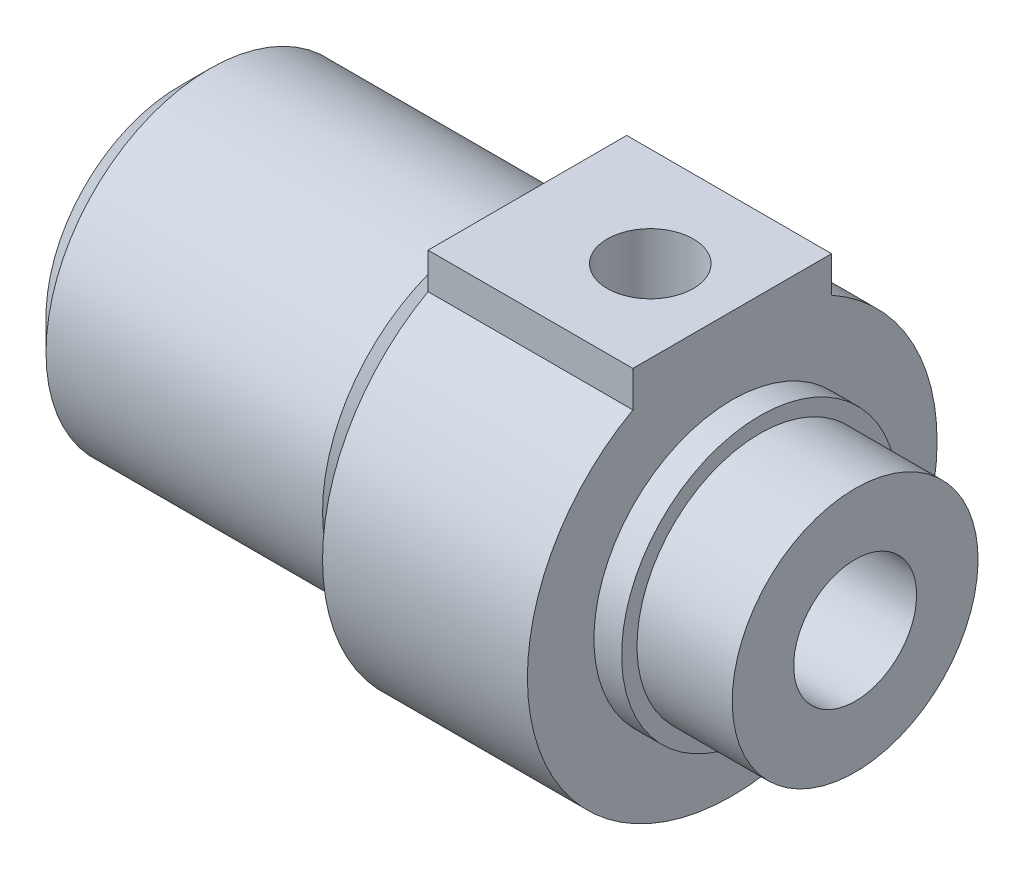
ISO-10303-21;
HEADER;
FILE_DESCRIPTION(('STEP AP214'),'2;1');
FILE_NAME('part.step','',(''),(''),'','','');
FILE_SCHEMA(('AUTOMOTIVE_DESIGN { 1 0 10303 214 1 1 1 1 }'));
ENDSEC;
DATA;
#1=APPLICATION_CONTEXT('core data for automotive mechanical design processes');
#2=APPLICATION_PROTOCOL_DEFINITION('international standard','automotive_design',2000,#1);
#3=PRODUCT_CONTEXT('',#1,'mechanical');
#4=PRODUCT('Part','Part','',(#3));
#5=PRODUCT_RELATED_PRODUCT_CATEGORY('part','',(#4));
#6=PRODUCT_DEFINITION_FORMATION('','',#4);
#7=PRODUCT_DEFINITION_CONTEXT('part definition',#1,'design');
#8=PRODUCT_DEFINITION('design','',#6,#7);
#9=PRODUCT_DEFINITION_SHAPE('','',#8);
#10=(LENGTH_UNIT() NAMED_UNIT(*) SI_UNIT(.MILLI.,.METRE.));
#11=(NAMED_UNIT(*) PLANE_ANGLE_UNIT() SI_UNIT($,.RADIAN.));
#12=(NAMED_UNIT(*) SI_UNIT($,.STERADIAN.) SOLID_ANGLE_UNIT());
#13=UNCERTAINTY_MEASURE_WITH_UNIT(LENGTH_MEASURE(1.E-05),#10,'distance_accuracy_value','');
#14=(GEOMETRIC_REPRESENTATION_CONTEXT(3) GLOBAL_UNCERTAINTY_ASSIGNED_CONTEXT((#13)) GLOBAL_UNIT_ASSIGNED_CONTEXT((#10,
#11,#12)) REPRESENTATION_CONTEXT('',''));
#15=CARTESIAN_POINT('',(0.,0.,0.));
#16=DIRECTION('',(0.,0.,1.));
#17=DIRECTION('',(1.,0.,0.));
#18=AXIS2_PLACEMENT_3D('',#15,#16,#17);
#19=CARTESIAN_POINT('',(33.,10.5,4.85));
#20=DIRECTION('',(0.,-1.,0.));
#21=DIRECTION('',(0.,0.,-1.));
#22=AXIS2_PLACEMENT_3D('',#19,#20,#21);
#23=PLANE('',#22);
#24=CARTESIAN_POINT('',(23.,10.5,0.));
#25=DIRECTION('',(0.,1.,0.));
#26=DIRECTION('',(0.,0.,1.));
#27=AXIS2_PLACEMENT_3D('',#24,#25,#26);
#28=CIRCLE('',#27,2.1);
#29=CARTESIAN_POINT('',(23.,10.5,2.1));
#30=VERTEX_POINT('',#29);
#31=EDGE_CURVE('E196',#30,#30,#28,.T.);
#32=ORIENTED_EDGE('',*,*,#31,.F.);
#33=EDGE_LOOP('',(#32));
#34=FACE_BOUND('',#33,.T.);
#35=DIRECTION('',(0.,0.,-1.));
#36=VECTOR('',#35,1.);
#37=CARTESIAN_POINT('',(17.,10.5,4.85));
#38=LINE('',#37,#36);
#39=CARTESIAN_POINT('',(17.,10.5,4.85));
#40=VERTEX_POINT('',#39);
#41=CARTESIAN_POINT('',(17.,10.5,-4.85));
#42=VERTEX_POINT('',#41);
#43=EDGE_CURVE('E58',#40,#42,#38,.T.);
#44=ORIENTED_EDGE('',*,*,#43,.F.);
#45=DIRECTION('',(-1.,0.,0.));
#46=VECTOR('',#45,1.);
#47=CARTESIAN_POINT('',(33.,10.5,4.85));
#48=LINE('',#47,#46);
#49=CARTESIAN_POINT('',(27.,10.5,4.85));
#50=VERTEX_POINT('',#49);
#51=EDGE_CURVE('E105',#50,#40,#48,.T.);
#52=ORIENTED_EDGE('',*,*,#51,.F.);
#53=DIRECTION('',(0.,0.,-1.));
#54=VECTOR('',#53,1.);
#55=CARTESIAN_POINT('',(27.,10.5,4.85));
#56=LINE('',#55,#54);
#57=CARTESIAN_POINT('',(27.,10.5,-4.85));
#58=VERTEX_POINT('',#57);
#59=EDGE_CURVE('E107',#50,#58,#56,.T.);
#60=ORIENTED_EDGE('',*,*,#59,.T.);
#61=DIRECTION('',(-1.,0.,0.));
#62=VECTOR('',#61,1.);
#63=CARTESIAN_POINT('',(33.,10.5,-4.85));
#64=LINE('',#63,#62);
#65=EDGE_CURVE('E103',#58,#42,#64,.T.);
#66=ORIENTED_EDGE('',*,*,#65,.T.);
#67=EDGE_LOOP('',(#44,#52,#60,#66));
#68=FACE_BOUND('',#67,.T.);
#69=ADVANCED_FACE('F37',(#34,#68),#23,.F.);
#70=CARTESIAN_POINT('',(33.,8.74514150828905,4.85));
#71=DIRECTION('',(0.,0.,-1.));
#72=DIRECTION('',(-1.,0.,0.));
#73=AXIS2_PLACEMENT_3D('',#70,#71,#72);
#74=PLANE('',#73);
#75=DIRECTION('',(0.,1.,0.));
#76=VECTOR('',#75,1.);
#77=CARTESIAN_POINT('',(17.,8.74514150828905,4.85));
#78=LINE('',#77,#76);
#79=CARTESIAN_POINT('',(17.,8.74514150828905,4.85));
#80=VERTEX_POINT('',#79);
#81=EDGE_CURVE('E99',#80,#40,#78,.T.);
#82=ORIENTED_EDGE('',*,*,#81,.F.);
#83=DIRECTION('',(-1.,0.,0.));
#84=VECTOR('',#83,1.);
#85=CARTESIAN_POINT('',(33.,8.74514150828905,4.85));
#86=LINE('',#85,#84);
#87=CARTESIAN_POINT('',(27.,8.74514150828905,4.85));
#88=VERTEX_POINT('',#87);
#89=EDGE_CURVE('E98',#88,#80,#86,.T.);
#90=ORIENTED_EDGE('',*,*,#89,.F.);
#91=DIRECTION('',(0.,1.,0.));
#92=VECTOR('',#91,1.);
#93=CARTESIAN_POINT('',(27.,8.74514150828905,4.85));
#94=LINE('',#93,#92);
#95=EDGE_CURVE('E225',#88,#50,#94,.T.);
#96=ORIENTED_EDGE('',*,*,#95,.T.);
#97=ORIENTED_EDGE('',*,*,#51,.T.);
#98=EDGE_LOOP('',(#82,#90,#96,#97));
#99=FACE_BOUND('',#98,.T.);
#100=ADVANCED_FACE('F133',(#99),#74,.F.);
#101=CARTESIAN_POINT('',(33.,0.,0.));
#102=DIRECTION('',(-1.,0.,0.));
#103=DIRECTION('',(0.,0.,1.));
#104=AXIS2_PLACEMENT_3D('',#101,#102,#103);
#105=CYLINDRICAL_SURFACE('',#104,10.);
#106=CARTESIAN_POINT('',(17.,0.,0.));
#107=DIRECTION('',(-1.,0.,0.));
#108=DIRECTION('',(0.,0.,1.));
#109=AXIS2_PLACEMENT_3D('',#106,#107,#108);
#110=CIRCLE('',#109,10.);
#111=CARTESIAN_POINT('',(17.,8.74514150828905,-4.85));
#112=VERTEX_POINT('',#111);
#113=EDGE_CURVE('E84',#112,#80,#110,.T.);
#114=ORIENTED_EDGE('',*,*,#113,.F.);
#115=DIRECTION('',(-1.,0.,0.));
#116=VECTOR('',#115,1.);
#117=CARTESIAN_POINT('',(33.,8.74514150828905,-4.85));
#118=LINE('',#117,#116);
#119=CARTESIAN_POINT('',(27.,8.74514150828905,-4.85));
#120=VERTEX_POINT('',#119);
#121=EDGE_CURVE('E96',#120,#112,#118,.T.);
#122=ORIENTED_EDGE('',*,*,#121,.F.);
#123=CARTESIAN_POINT('',(27.,0.,0.));
#124=DIRECTION('',(-1.,0.,0.));
#125=DIRECTION('',(0.,-1.,0.));
#126=AXIS2_PLACEMENT_3D('',#123,#124,#125);
#127=CIRCLE('',#126,10.);
#128=EDGE_CURVE('E66',#120,#88,#127,.T.);
#129=ORIENTED_EDGE('',*,*,#128,.T.);
#130=ORIENTED_EDGE('',*,*,#89,.T.);
#131=EDGE_LOOP('',(#114,#122,#129,#130));
#132=FACE_BOUND('',#131,.T.);
#133=ADVANCED_FACE('F95',(#132),#105,.T.);
#134=CARTESIAN_POINT('',(33.,8.74514150828905,-4.85));
#135=DIRECTION('',(0.,0.,1.));
#136=DIRECTION('',(1.,0.,0.));
#137=AXIS2_PLACEMENT_3D('',#134,#135,#136);
#138=PLANE('',#137);
#139=DIRECTION('',(0.,-1.,0.));
#140=VECTOR('',#139,1.);
#141=CARTESIAN_POINT('',(17.,8.74514150828905,-4.85));
#142=LINE('',#141,#140);
#143=EDGE_CURVE('E81',#42,#112,#142,.T.);
#144=ORIENTED_EDGE('',*,*,#143,.F.);
#145=ORIENTED_EDGE('',*,*,#65,.F.);
#146=DIRECTION('',(0.,-1.,0.));
#147=VECTOR('',#146,1.);
#148=CARTESIAN_POINT('',(27.,8.74514150828905,-4.85));
#149=LINE('',#148,#147);
#150=EDGE_CURVE('E90',#58,#120,#149,.T.);
#151=ORIENTED_EDGE('',*,*,#150,.T.);
#152=ORIENTED_EDGE('',*,*,#121,.T.);
#153=EDGE_LOOP('',(#144,#145,#151,#152));
#154=FACE_BOUND('',#153,.T.);
#155=ADVANCED_FACE('F102',(#154),#138,.F.);
#156=CARTESIAN_POINT('',(27.,14.,0.));
#157=DIRECTION('',(-1.,0.,0.));
#158=DIRECTION('',(0.,-1.,0.));
#159=AXIS2_PLACEMENT_3D('',#156,#157,#158);
#160=PLANE('',#159);
#161=CARTESIAN_POINT('',(27.,0.,0.));
#162=DIRECTION('',(1.,0.,0.));
#163=DIRECTION('',(0.,1.,0.));
#164=AXIS2_PLACEMENT_3D('',#161,#162,#163);
#165=CIRCLE('',#164,6.75);
#166=CARTESIAN_POINT('',(27.,6.75,0.));
#167=VERTEX_POINT('',#166);
#168=EDGE_CURVE('E221',#167,#167,#165,.T.);
#169=ORIENTED_EDGE('',*,*,#168,.F.);
#170=EDGE_LOOP('',(#169));
#171=FACE_BOUND('',#170,.T.);
#172=ORIENTED_EDGE('',*,*,#95,.F.);
#173=ORIENTED_EDGE('',*,*,#128,.F.);
#174=ORIENTED_EDGE('',*,*,#150,.F.);
#175=ORIENTED_EDGE('',*,*,#59,.F.);
#176=EDGE_LOOP('',(#172,#173,#174,#175));
#177=FACE_BOUND('',#176,.T.);
#178=ADVANCED_FACE('F146',(#171,#177),#160,.F.);
#179=CARTESIAN_POINT('',(45.5,0.,0.));
#180=DIRECTION('',(1.,0.,0.));
#181=DIRECTION('',(0.,1.,0.));
#182=AXIS2_PLACEMENT_3D('',#179,#180,#181);
#183=CYLINDRICAL_SURFACE('',#182,6.75);
#184=CARTESIAN_POINT('',(28.35,0.,0.));
#185=DIRECTION('',(1.,0.,0.));
#186=DIRECTION('',(0.,1.,0.));
#187=AXIS2_PLACEMENT_3D('',#184,#185,#186);
#188=CIRCLE('',#187,6.75);
#189=CARTESIAN_POINT('',(28.35,6.75,0.));
#190=VERTEX_POINT('',#189);
#191=EDGE_CURVE('E218',#190,#190,#188,.T.);
#192=ORIENTED_EDGE('',*,*,#191,.F.);
#193=EDGE_LOOP('',(#192));
#194=FACE_BOUND('',#193,.T.);
#195=ORIENTED_EDGE('',*,*,#168,.T.);
#196=EDGE_LOOP('',(#195));
#197=FACE_BOUND('',#196,.T.);
#198=ADVANCED_FACE('F155',(#194,#197),#183,.T.);
#199=CARTESIAN_POINT('',(28.35,6.75,0.));
#200=DIRECTION('',(-1.,0.,0.));
#201=DIRECTION('',(0.,-1.,0.));
#202=AXIS2_PLACEMENT_3D('',#199,#200,#201);
#203=PLANE('',#202);
#204=CARTESIAN_POINT('',(28.35,0.,0.));
#205=DIRECTION('',(1.,0.,0.));
#206=DIRECTION('',(0.,1.,0.));
#207=AXIS2_PLACEMENT_3D('',#204,#205,#206);
#208=CIRCLE('',#207,6.);
#209=CARTESIAN_POINT('',(28.35,6.,0.));
#210=VERTEX_POINT('',#209);
#211=EDGE_CURVE('E215',#210,#210,#208,.T.);
#212=ORIENTED_EDGE('',*,*,#211,.F.);
#213=EDGE_LOOP('',(#212));
#214=FACE_BOUND('',#213,.T.);
#215=ORIENTED_EDGE('',*,*,#191,.T.);
#216=EDGE_LOOP('',(#215));
#217=FACE_BOUND('',#216,.T.);
#218=ADVANCED_FACE('F159',(#214,#217),#203,.F.);
#219=CARTESIAN_POINT('',(45.5,0.,0.));
#220=DIRECTION('',(1.,0.,0.));
#221=DIRECTION('',(0.,1.,0.));
#222=AXIS2_PLACEMENT_3D('',#219,#220,#221);
#223=CYLINDRICAL_SURFACE('',#222,6.);
#224=CARTESIAN_POINT('',(33.,0.,0.));
#225=DIRECTION('',(1.,0.,0.));
#226=DIRECTION('',(0.,1.,0.));
#227=AXIS2_PLACEMENT_3D('',#224,#225,#226);
#228=CIRCLE('',#227,6.);
#229=CARTESIAN_POINT('',(33.,6.,0.));
#230=VERTEX_POINT('',#229);
#231=EDGE_CURVE('E212',#230,#230,#228,.T.);
#232=ORIENTED_EDGE('',*,*,#231,.F.);
#233=EDGE_LOOP('',(#232));
#234=FACE_BOUND('',#233,.T.);
#235=ORIENTED_EDGE('',*,*,#211,.T.);
#236=EDGE_LOOP('',(#235));
#237=FACE_BOUND('',#236,.T.);
#238=ADVANCED_FACE('F151',(#234,#237),#223,.T.);
#239=CARTESIAN_POINT('',(33.,0.,0.));
#240=DIRECTION('',(1.,0.,0.));
#241=DIRECTION('',(0.,0.,-1.));
#242=AXIS2_PLACEMENT_3D('',#239,#240,#241);
#243=PLANE('',#242);
#244=CARTESIAN_POINT('',(33.,0.,0.));
#245=DIRECTION('',(1.,0.,0.));
#246=DIRECTION('',(0.,0.,-1.));
#247=AXIS2_PLACEMENT_3D('',#244,#245,#246);
#248=CIRCLE('',#247,3.);
#249=CARTESIAN_POINT('',(33.,0.,-3.));
#250=VERTEX_POINT('',#249);
#251=EDGE_CURVE('E189',#250,#250,#248,.T.);
#252=ORIENTED_EDGE('',*,*,#251,.F.);
#253=EDGE_LOOP('',(#252));
#254=FACE_BOUND('',#253,.T.);
#255=ORIENTED_EDGE('',*,*,#231,.T.);
#256=EDGE_LOOP('',(#255));
#257=FACE_BOUND('',#256,.T.);
#258=ADVANCED_FACE('F148',(#254,#257),#243,.T.);
#259=CARTESIAN_POINT('',(17.,7.5,0.));
#260=DIRECTION('',(-1.,0.,0.));
#261=DIRECTION('',(0.,0.,1.));
#262=AXIS2_PLACEMENT_3D('',#259,#260,#261);
#263=PLANE('',#262);
#264=CARTESIAN_POINT('',(17.,0.,0.));
#265=DIRECTION('',(-1.,0.,0.));
#266=DIRECTION('',(0.,0.,1.));
#267=AXIS2_PLACEMENT_3D('',#264,#265,#266);
#268=CIRCLE('',#267,7.5);
#269=CARTESIAN_POINT('',(17.,0.,7.5));
#270=VERTEX_POINT('',#269);
#271=EDGE_CURVE('E100',#270,#270,#268,.T.);
#272=ORIENTED_EDGE('',*,*,#271,.F.);
#273=EDGE_LOOP('',(#272));
#274=FACE_BOUND('',#273,.T.);
#275=ORIENTED_EDGE('',*,*,#43,.T.);
#276=ORIENTED_EDGE('',*,*,#143,.T.);
#277=ORIENTED_EDGE('',*,*,#113,.T.);
#278=ORIENTED_EDGE('',*,*,#81,.T.);
#279=EDGE_LOOP('',(#275,#276,#277,#278));
#280=FACE_BOUND('',#279,.T.);
#281=ADVANCED_FACE('F83',(#274,#280),#263,.T.);
#282=CARTESIAN_POINT('',(0.,0.,0.));
#283=DIRECTION('',(-1.,0.,0.));
#284=DIRECTION('',(0.,0.,1.));
#285=AXIS2_PLACEMENT_3D('',#282,#283,#284);
#286=CYLINDRICAL_SURFACE('',#285,7.5);
#287=ORIENTED_EDGE('',*,*,#271,.T.);
#288=EDGE_LOOP('',(#287));
#289=FACE_BOUND('',#288,.T.);
#290=CARTESIAN_POINT('',(15.5,0.,0.));
#291=DIRECTION('',(-1.,0.,0.));
#292=DIRECTION('',(0.,0.,1.));
#293=AXIS2_PLACEMENT_3D('',#290,#291,#292);
#294=CIRCLE('',#293,7.5);
#295=CARTESIAN_POINT('',(15.5,0.,7.5));
#296=VERTEX_POINT('',#295);
#297=EDGE_CURVE('E205',#296,#296,#294,.T.);
#298=ORIENTED_EDGE('',*,*,#297,.F.);
#299=EDGE_LOOP('',(#298));
#300=FACE_BOUND('',#299,.T.);
#301=ADVANCED_FACE('F169',(#289,#300),#286,.T.);
#302=CARTESIAN_POINT('',(15.,0.,0.));
#303=DIRECTION('',(-1.,0.,0.));
#304=DIRECTION('',(0.,0.,1.));
#305=AXIS2_PLACEMENT_3D('',#302,#303,#304);
#306=CONICAL_SURFACE('',#305,8.,0.78539816339745);
#307=ORIENTED_EDGE('',*,*,#297,.T.);
#308=EDGE_LOOP('',(#307));
#309=FACE_BOUND('',#308,.T.);
#310=CARTESIAN_POINT('',(15.,0.,0.));
#311=DIRECTION('',(-1.,0.,0.));
#312=DIRECTION('',(0.,0.,1.));
#313=AXIS2_PLACEMENT_3D('',#310,#311,#312);
#314=CIRCLE('',#313,8.);
#315=CARTESIAN_POINT('',(15.,0.,8.));
#316=VERTEX_POINT('',#315);
#317=EDGE_CURVE('E198',#316,#316,#314,.T.);
#318=ORIENTED_EDGE('',*,*,#317,.F.);
#319=EDGE_LOOP('',(#318));
#320=FACE_BOUND('',#319,.T.);
#321=ADVANCED_FACE('F173',(#309,#320),#306,.T.);
#322=CARTESIAN_POINT('',(0.,0.,0.));
#323=DIRECTION('',(-1.,0.,0.));
#324=DIRECTION('',(0.,0.,1.));
#325=AXIS2_PLACEMENT_3D('',#322,#323,#324);
#326=CYLINDRICAL_SURFACE('',#325,8.);
#327=CARTESIAN_POINT('',(1.50000000000001,0.,0.));
#328=DIRECTION('',(1.,0.,0.));
#329=DIRECTION('',(0.,0.,-1.));
#330=AXIS2_PLACEMENT_3D('',#327,#328,#329);
#331=CIRCLE('',#330,8.);
#332=CARTESIAN_POINT('',(1.50000000000001,0.,-8.));
#333=VERTEX_POINT('',#332);
#334=EDGE_CURVE('E11',#333,#333,#331,.T.);
#335=ORIENTED_EDGE('',*,*,#334,.T.);
#336=EDGE_LOOP('',(#335));
#337=FACE_BOUND('',#336,.T.);
#338=ORIENTED_EDGE('',*,*,#317,.T.);
#339=EDGE_LOOP('',(#338));
#340=FACE_BOUND('',#339,.T.);
#341=ADVANCED_FACE('F128',(#337,#340),#326,.T.);
#342=CARTESIAN_POINT('',(0.,0.,0.));
#343=DIRECTION('',(1.,0.,0.));
#344=DIRECTION('',(0.,0.,-1.));
#345=AXIS2_PLACEMENT_3D('',#342,#343,#344);
#346=PLANE('',#345);
#347=CARTESIAN_POINT('',(0.,0.,0.));
#348=DIRECTION('',(1.,0.,0.));
#349=DIRECTION('',(0.,0.,-1.));
#350=AXIS2_PLACEMENT_3D('',#347,#348,#349);
#351=CIRCLE('',#350,3.);
#352=CARTESIAN_POINT('',(0.,0.,-3.));
#353=VERTEX_POINT('',#352);
#354=EDGE_CURVE('E193',#353,#353,#351,.T.);
#355=ORIENTED_EDGE('',*,*,#354,.T.);
#356=EDGE_LOOP('',(#355));
#357=FACE_BOUND('',#356,.T.);
#358=CARTESIAN_POINT('',(0.,0.,0.));
#359=DIRECTION('',(1.,0.,0.));
#360=DIRECTION('',(0.,0.,-1.));
#361=AXIS2_PLACEMENT_3D('',#358,#359,#360);
#362=CIRCLE('',#361,6.49999999999999);
#363=CARTESIAN_POINT('',(0.,0.,-6.49999999999999));
#364=VERTEX_POINT('',#363);
#365=EDGE_CURVE('E51',#364,#364,#362,.F.);
#366=ORIENTED_EDGE('',*,*,#365,.T.);
#367=EDGE_LOOP('',(#366));
#368=FACE_BOUND('',#367,.T.);
#369=ADVANCED_FACE('F117',(#357,#368),#346,.F.);
#370=CARTESIAN_POINT('',(0.,0.,0.));
#371=DIRECTION('',(1.,0.,0.));
#372=DIRECTION('',(0.,0.,-1.));
#373=AXIS2_PLACEMENT_3D('',#370,#371,#372);
#374=CONICAL_SURFACE('',#373,6.49999999999999,0.785398163397448);
#375=ORIENTED_EDGE('',*,*,#334,.F.);
#376=EDGE_LOOP('',(#375));
#377=FACE_BOUND('',#376,.T.);
#378=ORIENTED_EDGE('',*,*,#365,.F.);
#379=EDGE_LOOP('',(#378));
#380=FACE_BOUND('',#379,.T.);
#381=ADVANCED_FACE('F39',(#377,#380),#374,.T.);
#382=CARTESIAN_POINT('',(23.,10.5,0.));
#383=DIRECTION('',(0.,1.,0.));
#384=DIRECTION('',(0.,0.,1.));
#385=AXIS2_PLACEMENT_3D('',#382,#383,#384);
#386=CYLINDRICAL_SURFACE('',#385,2.1);
#387=CARTESIAN_POINT('',(23.,2.14242852856286,2.1));
#388=CARTESIAN_POINT('',(22.8991988179027,2.14243638279411,2.09999602164293));
#389=CARTESIAN_POINT('',(22.7983754728224,2.14968361222002,2.09267425451303));
#390=CARTESIAN_POINT('',(22.6004673952412,2.17713849427744,2.06408052690835));
#391=CARTESIAN_POINT('',(22.5033914844298,2.19737496074822,2.04277754974696));
#392=CARTESIAN_POINT('',(22.3165820766888,2.24699925671913,1.98804598401033));
#393=CARTESIAN_POINT('',(22.2267794921517,2.27628384865,1.95475351750639));
#394=CARTESIAN_POINT('',(22.0542401894225,2.34052168482311,1.87736165117184));
#395=CARTESIAN_POINT('',(21.971503963861,2.37547532379077,1.83326149871241));
#396=CARTESIAN_POINT('',(21.7995826235148,2.45442122730989,1.72654345994895));
#397=CARTESIAN_POINT('',(21.71180552072,2.49892440249037,1.66203515877101));
#398=CARTESIAN_POINT('',(21.5470635982075,2.587704985701,1.52013414958954));
#399=CARTESIAN_POINT('',(21.4701123074175,2.63198204575611,1.4427255794177));
#400=CARTESIAN_POINT('',(21.316441193349,2.72396309113983,1.26173250355452));
#401=CARTESIAN_POINT('',(21.2418942211988,2.7710097406898,1.15593562828217));
#402=CARTESIAN_POINT('',(21.1123767833799,2.85494261250272,0.929408573839368));
#403=CARTESIAN_POINT('',(21.0573671660404,2.89184912098326,0.80870892096122));
#404=CARTESIAN_POINT('',(20.9822063496233,2.94295124645066,0.589969945445681));
#405=CARTESIAN_POINT('',(20.9566581203425,2.96058586289675,0.494574305038635));
#406=CARTESIAN_POINT('',(20.9191737707145,2.98657838567664,0.299930223787058));
#407=CARTESIAN_POINT('',(20.9072267817453,2.99494369887954,0.200684924844656));
#408=CARTESIAN_POINT('',(20.8976169057927,3.00166671758024,0.000967143719220179));
#409=CARTESIAN_POINT('',(20.8999817606914,3.00000498681155,-0.0995073448428438));
#410=CARTESIAN_POINT('',(20.9189143274313,2.98678296023488,-0.298450041145121));
#411=CARTESIAN_POINT('',(20.9354859998781,2.97521990411617,-0.3969176815744));
#412=CARTESIAN_POINT('',(20.98136721481,2.9435711394848,-0.586910014758707));
#413=CARTESIAN_POINT('',(21.0103774656245,2.92368592848238,-0.678541865368288));
#414=CARTESIAN_POINT('',(21.0797757807128,2.876909009763,-0.855439349247825));
#415=CARTESIAN_POINT('',(21.1201660801607,2.85001592569624,-0.940703727706019));
#416=CARTESIAN_POINT('',(21.2160821260957,2.78763084510121,-1.11283793862578));
#417=CARTESIAN_POINT('',(21.2727978384847,2.75151250378176,-1.19881384252342));
#418=CARTESIAN_POINT('',(21.3970977260072,2.67523565239691,-1.3605619568758));
#419=CARTESIAN_POINT('',(21.4646936065031,2.63507280869808,-1.43632301459623));
#420=CARTESIAN_POINT('',(21.6225579565979,2.54604490567428,-1.58960261822576));
#421=CARTESIAN_POINT('',(21.7147195940943,2.4969066890714,-1.6650186720166));
#422=CARTESIAN_POINT('',(21.9115094955512,2.40154085459289,-1.79983510095356));
#423=CARTESIAN_POINT('',(22.0161345280853,2.3553124870012,-1.85923961448999));
#424=CARTESIAN_POINT('',(22.2114331109597,2.28159802338742,-1.94855264825869));
#425=CARTESIAN_POINT('',(22.2997254854026,2.25225087153781,-1.98210609109212));
#426=CARTESIAN_POINT('',(22.4822563241486,2.20236114038834,-2.03740031989552));
#427=CARTESIAN_POINT('',(22.5764832964627,2.18180211044458,-2.05916319745108));
#428=CARTESIAN_POINT('',(22.7699480304865,2.15261274855801,-2.08967380066584));
#429=CARTESIAN_POINT('',(22.8692268766363,2.14410534183546,-2.09828747378879));
#430=CARTESIAN_POINT('',(23.0681948287142,2.1412086525496,-2.10124630568856));
#431=CARTESIAN_POINT('',(23.1678837718425,2.14681422301691,-2.09559666625962));
#432=CARTESIAN_POINT('',(23.3501488282714,2.16922512584482,-2.07235487849599));
#433=CARTESIAN_POINT('',(23.4331776779779,2.18436555835548,-2.05653171310714));
#434=CARTESIAN_POINT('',(23.5951542045942,2.22215988293772,-2.01563399534999));
#435=CARTESIAN_POINT('',(23.6740974784041,2.2448216937327,-1.99054968944477));
#436=CARTESIAN_POINT('',(23.8630755821599,2.30728989885127,-1.91823476055615));
#437=CARTESIAN_POINT('',(23.9702383529714,2.35014375000236,-1.86613806390327));
#438=CARTESIAN_POINT('',(24.172912609648,2.44079519453309,-1.74591178220927));
#439=CARTESIAN_POINT('',(24.2684007614138,2.48860234700188,-1.67775086020861));
#440=CARTESIAN_POINT('',(24.4485250649496,2.58502403499954,-1.52511012344375));
#441=CARTESIAN_POINT('',(24.5329224098657,2.63363678085936,-1.44034661461234));
#442=CARTESIAN_POINT('',(24.6870337817786,2.72622495781879,-1.25629615404689));
#443=CARTESIAN_POINT('',(24.7567693386589,2.77020714050646,-1.15703086572033));
#444=CARTESIAN_POINT('',(24.8693222840851,2.84303432184209,-0.962367573398692));
#445=CARTESIAN_POINT('',(24.9146662316987,2.87317642109174,-0.868922194503136));
#446=CARTESIAN_POINT('',(24.9915502738121,2.92497219655113,-0.674279878008685));
#447=CARTESIAN_POINT('',(25.0230987416519,2.94663102095635,-0.573087686390255));
#448=CARTESIAN_POINT('',(25.0708367277367,2.97960788705012,-0.364831618377042));
#449=CARTESIAN_POINT('',(25.0869375148844,2.99086617475908,-0.257737513076736));
#450=CARTESIAN_POINT('',(25.1023699780085,3.00165393558886,-0.0417666466583805));
#451=CARTESIAN_POINT('',(25.1017081950419,3.0011879837197,0.0671094025392368));
#452=CARTESIAN_POINT('',(25.0845686089178,2.98921365831379,0.272289777850558));
#453=CARTESIAN_POINT('',(25.0696252775566,2.97877665808159,0.368792300103629));
#454=CARTESIAN_POINT('',(25.0269486580559,2.94928525203853,0.557534851493457));
#455=CARTESIAN_POINT('',(24.999212936831,2.93022920691689,0.64977406608462));
#456=CARTESIAN_POINT('',(24.9310361193616,2.88413721441091,0.831156056304381));
#457=CARTESIAN_POINT('',(24.8901841878995,2.85684523794218,0.920077354039737));
#458=CARTESIAN_POINT('',(24.7976386470762,2.79647566783174,1.08988850197529));
#459=CARTESIAN_POINT('',(24.7459429405351,2.76339695524428,1.17077679413152));
#460=CARTESIAN_POINT('',(24.6241705529461,2.68798939205913,1.33572629525633));
#461=CARTESIAN_POINT('',(24.5524836584681,2.64502293494774,1.41830558709393));
#462=CARTESIAN_POINT('',(24.3976783008358,2.55723192062595,1.57109978754637));
#463=CARTESIAN_POINT('',(24.3145360668307,2.51240363872625,1.64128827461709));
#464=CARTESIAN_POINT('',(24.1238335933986,2.4176556414013,1.77845654272628));
#465=CARTESIAN_POINT('',(24.0144895909964,2.36804412270408,1.84319523687473));
#466=CARTESIAN_POINT('',(23.7827353928988,2.27846176062126,1.9528530982932));
#467=CARTESIAN_POINT('',(23.660366231995,2.23846186201534,1.99783234726931));
#468=CARTESIAN_POINT('',(23.4472816295211,2.18705372583927,2.05371335315947));
#469=CARTESIAN_POINT('',(23.3594738103755,2.17056502262193,2.07096487029759));
#470=CARTESIAN_POINT('',(23.1811132360681,2.14825822428073,2.09410004221785));
#471=CARTESIAN_POINT('',(23.0905655632978,2.14242147187103,2.10000357438416));
#472=CARTESIAN_POINT('',(23.,2.14242852856286,2.1));
#473=B_SPLINE_CURVE_WITH_KNOTS('',3,(#387,#388,#389,#390,#391,#392,#393,#394,#395,#396,#397,
#398,#399,#400,#401,#402,#403,#404,#405,#406,#407,#408,#409,#410,#411,#412,#413,#414,#415,#416,
#417,#418,#419,#420,#421,#422,#423,#424,#425,#426,#427,#428,#429,#430,#431,#432,#433,#434,#435,
#436,#437,#438,#439,#440,#441,#442,#443,#444,#445,#446,#447,#448,#449,#450,#451,#452,#453,#454,
#455,#456,#457,#458,#459,#460,#461,#462,#463,#464,#465,#466,#467,#468,#469,#470,#471,#472),
.UNSPECIFIED.,.T.,.F.,(4,2,2,2,2,2,2,2,2,2,2,2,2,2,2,2,2,2,2,2,2,2,2,2,2,2,2,2,2,2,2,2,2,2,2,2,
2,2,2,2,2,2,4),(0.,0.301973223435531,0.604618635711376,0.903931039140896,1.20326429210161,
1.55501769378841,1.90720684651705,2.31804977810943,2.72806469734051,3.02773360434289,
3.32716288032116,3.62717275157128,3.92726628739669,4.22051205037772,4.51381545043928,
4.84003888345372,5.16661565707935,5.55151589746292,5.93631655978082,6.23199289437158,
6.52711329718779,6.82522273911176,7.12322347697785,7.37980613638281,7.6366597948759,
8.01451127327346,8.39310602933115,8.77884561454899,9.16401474783144,9.48714146722315,
9.81007178763062,10.134846099452,10.4594936804375,10.7527707598948,11.0461036430495,
11.3497065387119,11.6533682052277,12.0045164637744,12.3564046795999,12.7636402272857,
13.1696287925794,13.4414153585328,13.7127254216916),.UNSPECIFIED.);
#474=CARTESIAN_POINT('',(23.,2.14242852856286,2.1));
#475=VERTEX_POINT('',#474);
#476=EDGE_CURVE('E41',#475,#475,#473,.T.);
#477=ORIENTED_EDGE('',*,*,#476,.T.);
#478=EDGE_LOOP('',(#477));
#479=FACE_BOUND('',#478,.T.);
#480=ORIENTED_EDGE('',*,*,#31,.T.);
#481=EDGE_LOOP('',(#480));
#482=FACE_BOUND('',#481,.T.);
#483=ADVANCED_FACE('F120',(#479,#482),#386,.F.);
#484=CARTESIAN_POINT('',(0.,0.,0.));
#485=DIRECTION('',(1.,0.,0.));
#486=DIRECTION('',(0.,0.,-1.));
#487=AXIS2_PLACEMENT_3D('',#484,#485,#486);
#488=CYLINDRICAL_SURFACE('',#487,3.);
#489=ORIENTED_EDGE('',*,*,#251,.T.);
#490=EDGE_LOOP('',(#489));
#491=FACE_BOUND('',#490,.T.);
#492=ORIENTED_EDGE('',*,*,#354,.F.);
#493=EDGE_LOOP('',(#492));
#494=FACE_BOUND('',#493,.T.);
#495=ORIENTED_EDGE('',*,*,#476,.F.);
#496=EDGE_LOOP('',(#495));
#497=FACE_BOUND('',#496,.T.);
#498=ADVANCED_FACE('F126',(#491,#494,#497),#488,.F.);
#499=CLOSED_SHELL('',(#69,#100,#133,#155,#178,#198,#218,#238,#258,#281,#301,#321,#341,#369,#381,
#483,#498));
#500=MANIFOLD_SOLID_BREP('B2',#499);
#501=ADVANCED_BREP_SHAPE_REPRESENTATION('',(#18,#500),#14);
#502=SHAPE_DEFINITION_REPRESENTATION(#9,#501);
ENDSEC;
END-ISO-10303-21;
